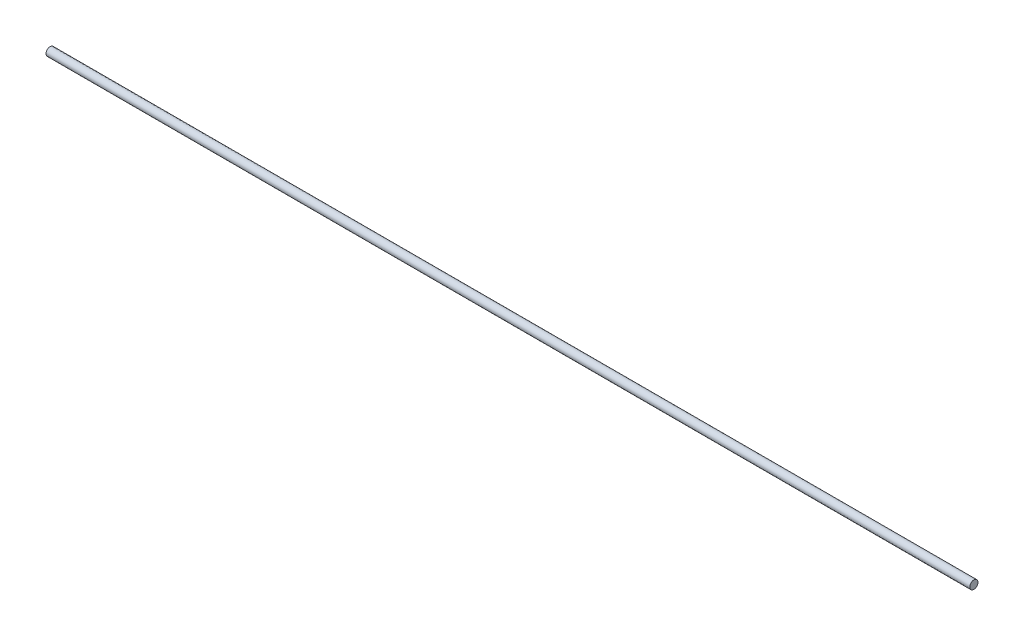
ISO-10303-21;
HEADER;
FILE_DESCRIPTION(('STEP AP214'),'2;1');
FILE_NAME('part.step','',(''),(''),'','','');
FILE_SCHEMA(('AUTOMOTIVE_DESIGN { 1 0 10303 214 1 1 1 1 }'));
ENDSEC;
DATA;
#1=APPLICATION_CONTEXT('core data for automotive mechanical design processes');
#2=APPLICATION_PROTOCOL_DEFINITION('international standard','automotive_design',2000,#1);
#3=PRODUCT_CONTEXT('',#1,'mechanical');
#4=PRODUCT('Part','Part','',(#3));
#5=PRODUCT_RELATED_PRODUCT_CATEGORY('part','',(#4));
#6=PRODUCT_DEFINITION_FORMATION('','',#4);
#7=PRODUCT_DEFINITION_CONTEXT('part definition',#1,'design');
#8=PRODUCT_DEFINITION('design','',#6,#7);
#9=PRODUCT_DEFINITION_SHAPE('','',#8);
#10=(LENGTH_UNIT() NAMED_UNIT(*) SI_UNIT(.MILLI.,.METRE.));
#11=(NAMED_UNIT(*) PLANE_ANGLE_UNIT() SI_UNIT($,.RADIAN.));
#12=(NAMED_UNIT(*) SI_UNIT($,.STERADIAN.) SOLID_ANGLE_UNIT());
#13=UNCERTAINTY_MEASURE_WITH_UNIT(LENGTH_MEASURE(1.E-05),#10,'distance_accuracy_value','');
#14=(GEOMETRIC_REPRESENTATION_CONTEXT(3) GLOBAL_UNCERTAINTY_ASSIGNED_CONTEXT((#13)) GLOBAL_UNIT_ASSIGNED_CONTEXT((#10,
#11,#12)) REPRESENTATION_CONTEXT('',''));
#15=CARTESIAN_POINT('',(0.,0.,0.));
#16=DIRECTION('',(0.,0.,1.));
#17=DIRECTION('',(1.,0.,0.));
#18=AXIS2_PLACEMENT_3D('',#15,#16,#17);
#19=CARTESIAN_POINT('',(711.2,0.,0.));
#20=DIRECTION('',(-1.,0.,0.));
#21=DIRECTION('',(0.,0.,1.));
#22=AXIS2_PLACEMENT_3D('',#19,#20,#21);
#23=CYLINDRICAL_SURFACE('',#22,3.175);
#24=CARTESIAN_POINT('',(711.2,0.,0.));
#25=DIRECTION('',(1.,0.,0.));
#26=DIRECTION('',(0.,0.,-1.));
#27=AXIS2_PLACEMENT_3D('',#24,#25,#26);
#28=CIRCLE('',#27,3.175);
#29=CARTESIAN_POINT('',(711.2,0.,-3.175));
#30=VERTEX_POINT('',#29);
#31=EDGE_CURVE('E12',#30,#30,#28,.T.);
#32=ORIENTED_EDGE('',*,*,#31,.F.);
#33=EDGE_LOOP('',(#32));
#34=FACE_BOUND('',#33,.T.);
#35=CARTESIAN_POINT('',(0.,0.,0.));
#36=DIRECTION('',(1.,0.,0.));
#37=DIRECTION('',(0.,0.,-1.));
#38=AXIS2_PLACEMENT_3D('',#35,#36,#37);
#39=CIRCLE('',#38,3.175);
#40=CARTESIAN_POINT('',(0.,0.,-3.175));
#41=VERTEX_POINT('',#40);
#42=EDGE_CURVE('E47',#41,#41,#39,.T.);
#43=ORIENTED_EDGE('',*,*,#42,.T.);
#44=EDGE_LOOP('',(#43));
#45=FACE_BOUND('',#44,.T.);
#46=ADVANCED_FACE('F44',(#34,#45),#23,.T.);
#47=CARTESIAN_POINT('',(711.2,0.,0.));
#48=DIRECTION('',(1.,0.,0.));
#49=DIRECTION('',(0.,0.,-1.));
#50=AXIS2_PLACEMENT_3D('',#47,#48,#49);
#51=PLANE('',#50);
#52=ORIENTED_EDGE('',*,*,#31,.T.);
#53=EDGE_LOOP('',(#52));
#54=FACE_BOUND('',#53,.T.);
#55=ADVANCED_FACE('F59',(#54),#51,.T.);
#56=CARTESIAN_POINT('',(0.,0.,0.));
#57=DIRECTION('',(1.,0.,0.));
#58=DIRECTION('',(0.,0.,-1.));
#59=AXIS2_PLACEMENT_3D('',#56,#57,#58);
#60=PLANE('',#59);
#61=ORIENTED_EDGE('',*,*,#42,.F.);
#62=EDGE_LOOP('',(#61));
#63=FACE_BOUND('',#62,.T.);
#64=ADVANCED_FACE('F57',(#63),#60,.F.);
#65=CLOSED_SHELL('',(#46,#55,#64));
#66=MANIFOLD_SOLID_BREP('B2',#65);
#67=ADVANCED_BREP_SHAPE_REPRESENTATION('',(#18,#66),#14);
#68=SHAPE_DEFINITION_REPRESENTATION(#9,#67);
ENDSEC;
END-ISO-10303-21;
